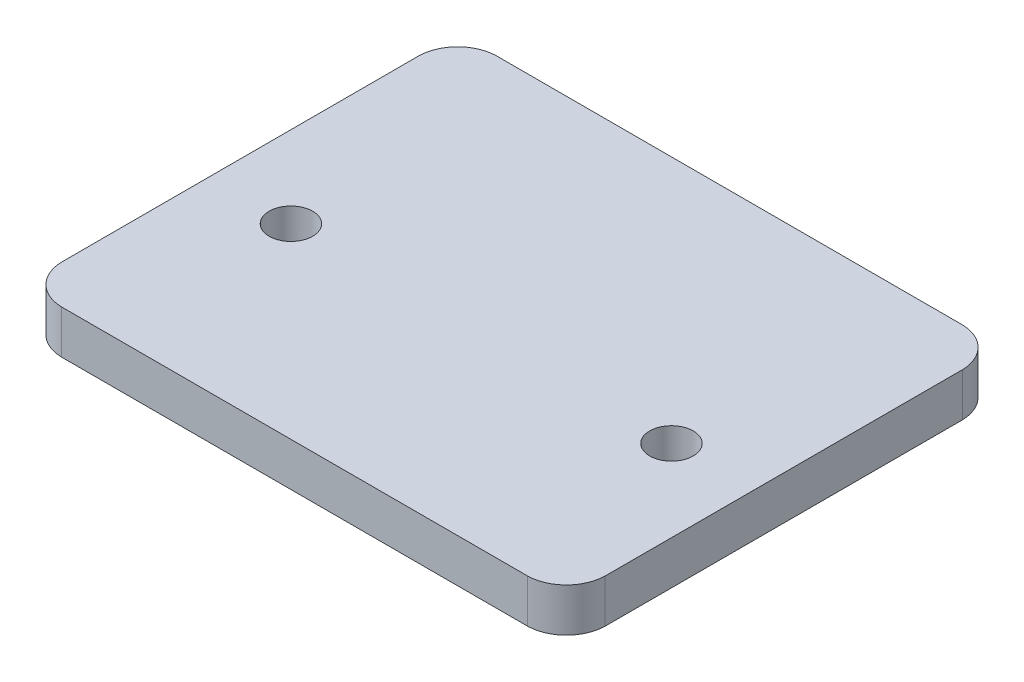
ISO-10303-21;
HEADER;
FILE_DESCRIPTION(('STEP AP214'),'2;1');
FILE_NAME('part.step','',(''),(''),'','','');
FILE_SCHEMA(('AUTOMOTIVE_DESIGN { 1 0 10303 214 1 1 1 1 }'));
ENDSEC;
DATA;
#1=APPLICATION_CONTEXT('core data for automotive mechanical design processes');
#2=APPLICATION_PROTOCOL_DEFINITION('international standard','automotive_design',2000,#1);
#3=PRODUCT_CONTEXT('',#1,'mechanical');
#4=PRODUCT('Part','Part','',(#3));
#5=PRODUCT_RELATED_PRODUCT_CATEGORY('part','',(#4));
#6=PRODUCT_DEFINITION_FORMATION('','',#4);
#7=PRODUCT_DEFINITION_CONTEXT('part definition',#1,'design');
#8=PRODUCT_DEFINITION('design','',#6,#7);
#9=PRODUCT_DEFINITION_SHAPE('','',#8);
#10=(LENGTH_UNIT() NAMED_UNIT(*) SI_UNIT(.MILLI.,.METRE.));
#11=(NAMED_UNIT(*) PLANE_ANGLE_UNIT() SI_UNIT($,.RADIAN.));
#12=(NAMED_UNIT(*) SI_UNIT($,.STERADIAN.) SOLID_ANGLE_UNIT());
#13=UNCERTAINTY_MEASURE_WITH_UNIT(LENGTH_MEASURE(1.E-05),#10,'distance_accuracy_value','');
#14=(GEOMETRIC_REPRESENTATION_CONTEXT(3) GLOBAL_UNCERTAINTY_ASSIGNED_CONTEXT((#13)) GLOBAL_UNIT_ASSIGNED_CONTEXT((#10,
#11,#12)) REPRESENTATION_CONTEXT('',''));
#15=CARTESIAN_POINT('',(0.,0.,0.));
#16=DIRECTION('',(0.,0.,1.));
#17=DIRECTION('',(1.,0.,0.));
#18=AXIS2_PLACEMENT_3D('',#15,#16,#17);
#19=CARTESIAN_POINT('',(21.3619626282644,4.,16.3619626282645));
#20=DIRECTION('',(0.,-1.,0.));
#21=DIRECTION('',(0.,0.,-1.));
#22=AXIS2_PLACEMENT_3D('',#19,#20,#21);
#23=CYLINDRICAL_SURFACE('',#22,3.63903046216359);
#24=CARTESIAN_POINT('',(21.3619626282644,0.,16.3619626282645));
#25=DIRECTION('',(0.,1.,0.));
#26=DIRECTION('',(0.,0.,1.));
#27=AXIS2_PLACEMENT_3D('',#24,#25,#26);
#28=CIRCLE('',#27,3.63903046216359);
#29=CARTESIAN_POINT('',(25.,0.,16.446973135908));
#30=VERTEX_POINT('',#29);
#31=CARTESIAN_POINT('',(21.4469731359103,0.,20.));
#32=VERTEX_POINT('',#31);
#33=EDGE_CURVE('E143',#30,#32,#28,.F.);
#34=ORIENTED_EDGE('',*,*,#33,.F.);
#35=DIRECTION('',(0.,-1.,0.));
#36=VECTOR('',#35,1.);
#37=CARTESIAN_POINT('',(25.,4.,16.446973135908));
#38=LINE('',#37,#36);
#39=CARTESIAN_POINT('',(25.,4.,16.446973135908));
#40=VERTEX_POINT('',#39);
#41=EDGE_CURVE('E12',#40,#30,#38,.T.);
#42=ORIENTED_EDGE('',*,*,#41,.F.);
#43=CARTESIAN_POINT('',(21.3619626282644,4.,16.3619626282645));
#44=DIRECTION('',(0.,1.,0.));
#45=DIRECTION('',(0.,0.,1.));
#46=AXIS2_PLACEMENT_3D('',#43,#44,#45);
#47=CIRCLE('',#46,3.63903046216359);
#48=CARTESIAN_POINT('',(21.4469731359103,4.,20.));
#49=VERTEX_POINT('',#48);
#50=EDGE_CURVE('E169',#40,#49,#47,.F.);
#51=ORIENTED_EDGE('',*,*,#50,.T.);
#52=DIRECTION('',(0.,-1.,0.));
#53=VECTOR('',#52,1.);
#54=CARTESIAN_POINT('',(21.4469731359103,4.,20.));
#55=LINE('',#54,#53);
#56=EDGE_CURVE('E95',#49,#32,#55,.T.);
#57=ORIENTED_EDGE('',*,*,#56,.T.);
#58=EDGE_LOOP('',(#34,#42,#51,#57));
#59=FACE_BOUND('',#58,.T.);
#60=ADVANCED_FACE('F44',(#59),#23,.T.);
#61=CARTESIAN_POINT('',(25.,4.,0.));
#62=DIRECTION('',(1.,0.,0.));
#63=DIRECTION('',(0.,0.,-1.));
#64=AXIS2_PLACEMENT_3D('',#61,#62,#63);
#65=PLANE('',#64);
#66=DIRECTION('',(0.,0.,1.));
#67=VECTOR('',#66,1.);
#68=CARTESIAN_POINT('',(25.,0.,0.));
#69=LINE('',#68,#67);
#70=CARTESIAN_POINT('',(25.,0.,-16.4469731359106));
#71=VERTEX_POINT('',#70);
#72=EDGE_CURVE('E146',#71,#30,#69,.T.);
#73=ORIENTED_EDGE('',*,*,#72,.F.);
#74=DIRECTION('',(0.,-1.,0.));
#75=VECTOR('',#74,1.);
#76=CARTESIAN_POINT('',(25.,4.,-16.4469731359106));
#77=LINE('',#76,#75);
#78=CARTESIAN_POINT('',(25.,4.,-16.4469731359106));
#79=VERTEX_POINT('',#78);
#80=EDGE_CURVE('E52',#79,#71,#77,.T.);
#81=ORIENTED_EDGE('',*,*,#80,.F.);
#82=DIRECTION('',(0.,0.,1.));
#83=VECTOR('',#82,1.);
#84=CARTESIAN_POINT('',(25.,4.,0.));
#85=LINE('',#84,#83);
#86=EDGE_CURVE('E191',#79,#40,#85,.T.);
#87=ORIENTED_EDGE('',*,*,#86,.T.);
#88=ORIENTED_EDGE('',*,*,#41,.T.);
#89=EDGE_LOOP('',(#73,#81,#87,#88));
#90=FACE_BOUND('',#89,.T.);
#91=ADVANCED_FACE('F190',(#90),#65,.T.);
#92=CARTESIAN_POINT('',(21.3619626282645,4.,-16.3619626282644));
#93=DIRECTION('',(0.,-1.,0.));
#94=DIRECTION('',(0.,0.,-1.));
#95=AXIS2_PLACEMENT_3D('',#92,#93,#94);
#96=CYLINDRICAL_SURFACE('',#95,3.63903046216359);
#97=CARTESIAN_POINT('',(21.3619626282645,0.,-16.3619626282644));
#98=DIRECTION('',(0.,1.,0.));
#99=DIRECTION('',(0.,0.,1.));
#100=AXIS2_PLACEMENT_3D('',#97,#98,#99);
#101=CIRCLE('',#100,3.63903046216359);
#102=CARTESIAN_POINT('',(21.446973135908,0.,-20.));
#103=VERTEX_POINT('',#102);
#104=EDGE_CURVE('E150',#71,#103,#101,.T.);
#105=ORIENTED_EDGE('',*,*,#104,.T.);
#106=DIRECTION('',(0.,-1.,0.));
#107=VECTOR('',#106,1.);
#108=CARTESIAN_POINT('',(21.446973135908,4.,-20.));
#109=LINE('',#108,#107);
#110=CARTESIAN_POINT('',(21.446973135908,4.,-20.));
#111=VERTEX_POINT('',#110);
#112=EDGE_CURVE('E175',#111,#103,#109,.T.);
#113=ORIENTED_EDGE('',*,*,#112,.F.);
#114=CARTESIAN_POINT('',(21.3619626282645,4.,-16.3619626282644));
#115=DIRECTION('',(0.,1.,0.));
#116=DIRECTION('',(0.,0.,1.));
#117=AXIS2_PLACEMENT_3D('',#114,#115,#116);
#118=CIRCLE('',#117,3.63903046216359);
#119=EDGE_CURVE('E181',#79,#111,#118,.T.);
#120=ORIENTED_EDGE('',*,*,#119,.F.);
#121=ORIENTED_EDGE('',*,*,#80,.T.);
#122=EDGE_LOOP('',(#105,#113,#120,#121));
#123=FACE_BOUND('',#122,.T.);
#124=ADVANCED_FACE('F179',(#123),#96,.T.);
#125=CARTESIAN_POINT('',(0.,4.,-20.));
#126=DIRECTION('',(0.,0.,-1.));
#127=DIRECTION('',(-1.,0.,0.));
#128=AXIS2_PLACEMENT_3D('',#125,#126,#127);
#129=PLANE('',#128);
#130=DIRECTION('',(1.,0.,0.));
#131=VECTOR('',#130,1.);
#132=CARTESIAN_POINT('',(0.,0.,-20.));
#133=LINE('',#132,#131);
#134=CARTESIAN_POINT('',(-21.4469731359094,0.,-20.));
#135=VERTEX_POINT('',#134);
#136=EDGE_CURVE('E153',#135,#103,#133,.T.);
#137=ORIENTED_EDGE('',*,*,#136,.F.);
#138=DIRECTION('',(0.,-1.,0.));
#139=VECTOR('',#138,1.);
#140=CARTESIAN_POINT('',(-21.4469731359094,4.,-20.));
#141=LINE('',#140,#139);
#142=CARTESIAN_POINT('',(-21.4469731359094,4.,-20.));
#143=VERTEX_POINT('',#142);
#144=EDGE_CURVE('E173',#143,#135,#141,.T.);
#145=ORIENTED_EDGE('',*,*,#144,.F.);
#146=DIRECTION('',(1.,0.,0.));
#147=VECTOR('',#146,1.);
#148=CARTESIAN_POINT('',(0.,4.,-20.));
#149=LINE('',#148,#147);
#150=EDGE_CURVE('E202',#143,#111,#149,.T.);
#151=ORIENTED_EDGE('',*,*,#150,.T.);
#152=ORIENTED_EDGE('',*,*,#112,.T.);
#153=EDGE_LOOP('',(#137,#145,#151,#152));
#154=FACE_BOUND('',#153,.T.);
#155=ADVANCED_FACE('F208',(#154),#129,.T.);
#156=CARTESIAN_POINT('',(-21.3619626282644,4.,-16.3619626282644));
#157=DIRECTION('',(0.,-1.,0.));
#158=DIRECTION('',(0.,0.,-1.));
#159=AXIS2_PLACEMENT_3D('',#156,#157,#158);
#160=CYLINDRICAL_SURFACE('',#159,3.63903046216359);
#161=CARTESIAN_POINT('',(-21.3619626282644,0.,-16.3619626282644));
#162=DIRECTION('',(0.,1.,0.));
#163=DIRECTION('',(0.,0.,1.));
#164=AXIS2_PLACEMENT_3D('',#161,#162,#163);
#165=CIRCLE('',#164,3.63903046216359);
#166=CARTESIAN_POINT('',(-25.,0.,-16.4469731359086));
#167=VERTEX_POINT('',#166);
#168=EDGE_CURVE('E156',#167,#135,#165,.F.);
#169=ORIENTED_EDGE('',*,*,#168,.F.);
#170=DIRECTION('',(0.,-1.,0.));
#171=VECTOR('',#170,1.);
#172=CARTESIAN_POINT('',(-25.,4.,-16.4469731359086));
#173=LINE('',#172,#171);
#174=CARTESIAN_POINT('',(-25.,4.,-16.4469731359086));
#175=VERTEX_POINT('',#174);
#176=EDGE_CURVE('E129',#175,#167,#173,.T.);
#177=ORIENTED_EDGE('',*,*,#176,.F.);
#178=CARTESIAN_POINT('',(-21.3619626282644,4.,-16.3619626282644));
#179=DIRECTION('',(0.,1.,0.));
#180=DIRECTION('',(0.,0.,1.));
#181=AXIS2_PLACEMENT_3D('',#178,#179,#180);
#182=CIRCLE('',#181,3.63903046216359);
#183=EDGE_CURVE('E122',#175,#143,#182,.F.);
#184=ORIENTED_EDGE('',*,*,#183,.T.);
#185=ORIENTED_EDGE('',*,*,#144,.T.);
#186=EDGE_LOOP('',(#169,#177,#184,#185));
#187=FACE_BOUND('',#186,.T.);
#188=ADVANCED_FACE('F206',(#187),#160,.T.);
#189=CARTESIAN_POINT('',(-25.,4.,0.));
#190=DIRECTION('',(1.,0.,0.));
#191=DIRECTION('',(0.,0.,-1.));
#192=AXIS2_PLACEMENT_3D('',#189,#190,#191);
#193=PLANE('',#192);
#194=DIRECTION('',(0.,0.,1.));
#195=VECTOR('',#194,1.);
#196=CARTESIAN_POINT('',(-25.,0.,0.));
#197=LINE('',#196,#195);
#198=CARTESIAN_POINT('',(-25.,0.,16.4469731359088));
#199=VERTEX_POINT('',#198);
#200=EDGE_CURVE('E128',#167,#199,#197,.T.);
#201=ORIENTED_EDGE('',*,*,#200,.T.);
#202=DIRECTION('',(0.,-1.,0.));
#203=VECTOR('',#202,1.);
#204=CARTESIAN_POINT('',(-25.,4.,16.4469731359088));
#205=LINE('',#204,#203);
#206=CARTESIAN_POINT('',(-25.,4.,16.4469731359088));
#207=VERTEX_POINT('',#206);
#208=EDGE_CURVE('E125',#207,#199,#205,.T.);
#209=ORIENTED_EDGE('',*,*,#208,.F.);
#210=DIRECTION('',(0.,0.,1.));
#211=VECTOR('',#210,1.);
#212=CARTESIAN_POINT('',(-25.,4.,0.));
#213=LINE('',#212,#211);
#214=EDGE_CURVE('E114',#175,#207,#213,.T.);
#215=ORIENTED_EDGE('',*,*,#214,.F.);
#216=ORIENTED_EDGE('',*,*,#176,.T.);
#217=EDGE_LOOP('',(#201,#209,#215,#216));
#218=FACE_BOUND('',#217,.T.);
#219=ADVANCED_FACE('F126',(#218),#193,.F.);
#220=CARTESIAN_POINT('',(-21.3619626282644,4.,16.3619626282644));
#221=DIRECTION('',(0.,-1.,0.));
#222=DIRECTION('',(0.,0.,-1.));
#223=AXIS2_PLACEMENT_3D('',#220,#221,#222);
#224=CYLINDRICAL_SURFACE('',#223,3.63903046216359);
#225=CARTESIAN_POINT('',(-21.3619626282644,0.,16.3619626282644));
#226=DIRECTION('',(0.,1.,0.));
#227=DIRECTION('',(0.,0.,1.));
#228=AXIS2_PLACEMENT_3D('',#225,#226,#227);
#229=CIRCLE('',#228,3.63903046216359);
#230=CARTESIAN_POINT('',(-21.4469731359088,0.,20.));
#231=VERTEX_POINT('',#230);
#232=EDGE_CURVE('E88',#199,#231,#229,.T.);
#233=ORIENTED_EDGE('',*,*,#232,.T.);
#234=DIRECTION('',(0.,-1.,0.));
#235=VECTOR('',#234,1.);
#236=CARTESIAN_POINT('',(-21.4469731359088,4.,20.));
#237=LINE('',#236,#235);
#238=CARTESIAN_POINT('',(-21.4469731359088,4.,20.));
#239=VERTEX_POINT('',#238);
#240=EDGE_CURVE('E130',#239,#231,#237,.T.);
#241=ORIENTED_EDGE('',*,*,#240,.F.);
#242=CARTESIAN_POINT('',(-21.3619626282644,4.,16.3619626282644));
#243=DIRECTION('',(0.,1.,0.));
#244=DIRECTION('',(0.,0.,1.));
#245=AXIS2_PLACEMENT_3D('',#242,#243,#244);
#246=CIRCLE('',#245,3.63903046216359);
#247=EDGE_CURVE('E119',#207,#239,#246,.T.);
#248=ORIENTED_EDGE('',*,*,#247,.F.);
#249=ORIENTED_EDGE('',*,*,#208,.T.);
#250=EDGE_LOOP('',(#233,#241,#248,#249));
#251=FACE_BOUND('',#250,.T.);
#252=ADVANCED_FACE('F132',(#251),#224,.T.);
#253=CARTESIAN_POINT('',(17.4927855675265,4.,2.82596315446246));
#254=DIRECTION('',(0.,-1.,0.));
#255=DIRECTION('',(0.,0.,-1.));
#256=AXIS2_PLACEMENT_3D('',#253,#254,#255);
#257=CYLINDRICAL_SURFACE('',#256,2.);
#258=CARTESIAN_POINT('',(17.4927855675265,4.,2.82596315446246));
#259=DIRECTION('',(0.,1.,0.));
#260=DIRECTION('',(0.,0.,1.));
#261=AXIS2_PLACEMENT_3D('',#258,#259,#260);
#262=CIRCLE('',#261,2.);
#263=CARTESIAN_POINT('',(17.4927855675265,4.,4.82596315446246));
#264=VERTEX_POINT('',#263);
#265=EDGE_CURVE('E134',#264,#264,#262,.T.);
#266=ORIENTED_EDGE('',*,*,#265,.T.);
#267=EDGE_LOOP('',(#266));
#268=FACE_BOUND('',#267,.T.);
#269=CARTESIAN_POINT('',(17.4927855675265,0.,2.82596315446246));
#270=DIRECTION('',(0.,1.,0.));
#271=DIRECTION('',(0.,0.,1.));
#272=AXIS2_PLACEMENT_3D('',#269,#270,#271);
#273=CIRCLE('',#272,2.);
#274=CARTESIAN_POINT('',(17.4927855675265,0.,4.82596315446246));
#275=VERTEX_POINT('',#274);
#276=EDGE_CURVE('E163',#275,#275,#273,.T.);
#277=ORIENTED_EDGE('',*,*,#276,.F.);
#278=EDGE_LOOP('',(#277));
#279=FACE_BOUND('',#278,.T.);
#280=ADVANCED_FACE('F254',(#268,#279),#257,.F.);
#281=CARTESIAN_POINT('',(0.,4.,20.));
#282=DIRECTION('',(0.,0.,-1.));
#283=DIRECTION('',(-1.,0.,0.));
#284=AXIS2_PLACEMENT_3D('',#281,#282,#283);
#285=PLANE('',#284);
#286=DIRECTION('',(1.,0.,0.));
#287=VECTOR('',#286,1.);
#288=CARTESIAN_POINT('',(0.,0.,20.));
#289=LINE('',#288,#287);
#290=EDGE_CURVE('E161',#231,#32,#289,.T.);
#291=ORIENTED_EDGE('',*,*,#290,.T.);
#292=ORIENTED_EDGE('',*,*,#56,.F.);
#293=DIRECTION('',(1.,0.,0.));
#294=VECTOR('',#293,1.);
#295=CARTESIAN_POINT('',(0.,4.,20.));
#296=LINE('',#295,#294);
#297=EDGE_CURVE('E60',#239,#49,#296,.T.);
#298=ORIENTED_EDGE('',*,*,#297,.F.);
#299=ORIENTED_EDGE('',*,*,#240,.T.);
#300=EDGE_LOOP('',(#291,#292,#298,#299));
#301=FACE_BOUND('',#300,.T.);
#302=ADVANCED_FACE('F194',(#301),#285,.F.);
#303=CARTESIAN_POINT('',(-17.5072144324735,4.,2.82596315446248));
#304=DIRECTION('',(0.,-1.,0.));
#305=DIRECTION('',(0.,0.,-1.));
#306=AXIS2_PLACEMENT_3D('',#303,#304,#305);
#307=CYLINDRICAL_SURFACE('',#306,2.);
#308=CARTESIAN_POINT('',(-17.5072144324735,4.,2.82596315446248));
#309=DIRECTION('',(0.,1.,0.));
#310=DIRECTION('',(0.,0.,1.));
#311=AXIS2_PLACEMENT_3D('',#308,#309,#310);
#312=CIRCLE('',#311,2.);
#313=CARTESIAN_POINT('',(-17.5072144324735,4.,4.82596315446248));
#314=VERTEX_POINT('',#313);
#315=EDGE_CURVE('E140',#314,#314,#312,.T.);
#316=ORIENTED_EDGE('',*,*,#315,.T.);
#317=EDGE_LOOP('',(#316));
#318=FACE_BOUND('',#317,.T.);
#319=CARTESIAN_POINT('',(-17.5072144324735,0.,2.82596315446248));
#320=DIRECTION('',(0.,1.,0.));
#321=DIRECTION('',(0.,0.,1.));
#322=AXIS2_PLACEMENT_3D('',#319,#320,#321);
#323=CIRCLE('',#322,2.);
#324=CARTESIAN_POINT('',(-17.5072144324735,0.,4.82596315446248));
#325=VERTEX_POINT('',#324);
#326=EDGE_CURVE('E166',#325,#325,#323,.T.);
#327=ORIENTED_EDGE('',*,*,#326,.F.);
#328=EDGE_LOOP('',(#327));
#329=FACE_BOUND('',#328,.T.);
#330=ADVANCED_FACE('F272',(#318,#329),#307,.F.);
#331=CARTESIAN_POINT('',(0.,4.,0.));
#332=DIRECTION('',(0.,1.,0.));
#333=DIRECTION('',(0.,0.,1.));
#334=AXIS2_PLACEMENT_3D('',#331,#332,#333);
#335=PLANE('',#334);
#336=ORIENTED_EDGE('',*,*,#50,.F.);
#337=ORIENTED_EDGE('',*,*,#86,.F.);
#338=ORIENTED_EDGE('',*,*,#119,.T.);
#339=ORIENTED_EDGE('',*,*,#150,.F.);
#340=ORIENTED_EDGE('',*,*,#183,.F.);
#341=ORIENTED_EDGE('',*,*,#214,.T.);
#342=ORIENTED_EDGE('',*,*,#247,.T.);
#343=ORIENTED_EDGE('',*,*,#297,.T.);
#344=EDGE_LOOP('',(#336,#337,#338,#339,#340,#341,#342,#343));
#345=FACE_BOUND('',#344,.T.);
#346=ORIENTED_EDGE('',*,*,#265,.F.);
#347=EDGE_LOOP('',(#346));
#348=FACE_BOUND('',#347,.T.);
#349=ORIENTED_EDGE('',*,*,#315,.F.);
#350=EDGE_LOOP('',(#349));
#351=FACE_BOUND('',#350,.T.);
#352=ADVANCED_FACE('F116',(#345,#348,#351),#335,.T.);
#353=CARTESIAN_POINT('',(0.,0.,0.));
#354=DIRECTION('',(0.,1.,0.));
#355=DIRECTION('',(0.,0.,1.));
#356=AXIS2_PLACEMENT_3D('',#353,#354,#355);
#357=PLANE('',#356);
#358=CARTESIAN_POINT('',(0.,0.,-5.27658028243268));
#359=DIRECTION('',(0.,1.,0.));
#360=DIRECTION('',(0.,0.,1.));
#361=AXIS2_PLACEMENT_3D('',#358,#359,#360);
#362=CIRCLE('',#361,4.5);
#363=CARTESIAN_POINT('',(0.,0.,-0.776580282432678));
#364=VERTEX_POINT('',#363);
#365=EDGE_CURVE('E198',#364,#364,#362,.T.);
#366=ORIENTED_EDGE('',*,*,#365,.T.);
#367=EDGE_LOOP('',(#366));
#368=FACE_BOUND('',#367,.T.);
#369=ORIENTED_EDGE('',*,*,#33,.T.);
#370=ORIENTED_EDGE('',*,*,#290,.F.);
#371=ORIENTED_EDGE('',*,*,#232,.F.);
#372=ORIENTED_EDGE('',*,*,#200,.F.);
#373=ORIENTED_EDGE('',*,*,#168,.T.);
#374=ORIENTED_EDGE('',*,*,#136,.T.);
#375=ORIENTED_EDGE('',*,*,#104,.F.);
#376=ORIENTED_EDGE('',*,*,#72,.T.);
#377=EDGE_LOOP('',(#369,#370,#371,#372,#373,#374,#375,#376));
#378=FACE_BOUND('',#377,.T.);
#379=ORIENTED_EDGE('',*,*,#276,.T.);
#380=EDGE_LOOP('',(#379));
#381=FACE_BOUND('',#380,.T.);
#382=ORIENTED_EDGE('',*,*,#326,.T.);
#383=EDGE_LOOP('',(#382));
#384=FACE_BOUND('',#383,.T.);
#385=ADVANCED_FACE('F187',(#368,#378,#381,#384),#357,.F.);
#386=CARTESIAN_POINT('',(0.,2.,-5.27658028243268));
#387=DIRECTION('',(0.,-1.,0.));
#388=DIRECTION('',(0.,0.,-1.));
#389=AXIS2_PLACEMENT_3D('',#386,#387,#388);
#390=CYLINDRICAL_SURFACE('',#389,4.5);
#391=CARTESIAN_POINT('',(0.,2.,-5.27658028243268));
#392=DIRECTION('',(0.,1.,0.));
#393=DIRECTION('',(0.,0.,1.));
#394=AXIS2_PLACEMENT_3D('',#391,#392,#393);
#395=CIRCLE('',#394,4.5);
#396=CARTESIAN_POINT('',(0.,2.,-0.776580282432678));
#397=VERTEX_POINT('',#396);
#398=EDGE_CURVE('E147',#397,#397,#395,.T.);
#399=ORIENTED_EDGE('',*,*,#398,.T.);
#400=EDGE_LOOP('',(#399));
#401=FACE_BOUND('',#400,.T.);
#402=ORIENTED_EDGE('',*,*,#365,.F.);
#403=EDGE_LOOP('',(#402));
#404=FACE_BOUND('',#403,.T.);
#405=ADVANCED_FACE('F298',(#401,#404),#390,.F.);
#406=CARTESIAN_POINT('',(0.,2.,0.));
#407=DIRECTION('',(0.,1.,0.));
#408=DIRECTION('',(0.,0.,1.));
#409=AXIS2_PLACEMENT_3D('',#406,#407,#408);
#410=PLANE('',#409);
#411=ORIENTED_EDGE('',*,*,#398,.F.);
#412=EDGE_LOOP('',(#411));
#413=FACE_BOUND('',#412,.T.);
#414=ADVANCED_FACE('F308',(#413),#410,.F.);
#415=CLOSED_SHELL('',(#60,#91,#124,#155,#188,#219,#252,#280,#302,#330,#352,#385,#405,#414));
#416=MANIFOLD_SOLID_BREP('B2',#415);
#417=ADVANCED_BREP_SHAPE_REPRESENTATION('',(#18,#416),#14);
#418=SHAPE_DEFINITION_REPRESENTATION(#9,#417);
ENDSEC;
END-ISO-10303-21;
